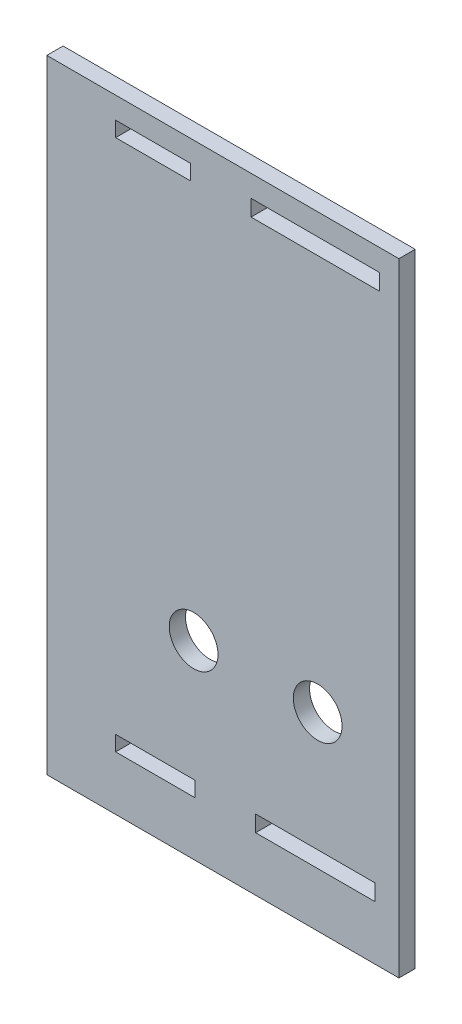
ISO-10303-21;
HEADER;
FILE_DESCRIPTION(('STEP AP214'),'2;1');
FILE_NAME('part.step','',(''),(''),'','','');
FILE_SCHEMA(('AUTOMOTIVE_DESIGN { 1 0 10303 214 1 1 1 1 }'));
ENDSEC;
DATA;
#1=APPLICATION_CONTEXT('core data for automotive mechanical design processes');
#2=APPLICATION_PROTOCOL_DEFINITION('international standard','automotive_design',2000,#1);
#3=PRODUCT_CONTEXT('',#1,'mechanical');
#4=PRODUCT('Part','Part','',(#3));
#5=PRODUCT_RELATED_PRODUCT_CATEGORY('part','',(#4));
#6=PRODUCT_DEFINITION_FORMATION('','',#4);
#7=PRODUCT_DEFINITION_CONTEXT('part definition',#1,'design');
#8=PRODUCT_DEFINITION('design','',#6,#7);
#9=PRODUCT_DEFINITION_SHAPE('','',#8);
#10=(LENGTH_UNIT() NAMED_UNIT(*) SI_UNIT(.MILLI.,.METRE.));
#11=(NAMED_UNIT(*) PLANE_ANGLE_UNIT() SI_UNIT($,.RADIAN.));
#12=(NAMED_UNIT(*) SI_UNIT($,.STERADIAN.) SOLID_ANGLE_UNIT());
#13=UNCERTAINTY_MEASURE_WITH_UNIT(LENGTH_MEASURE(1.E-05),#10,'distance_accuracy_value','');
#14=(GEOMETRIC_REPRESENTATION_CONTEXT(3) GLOBAL_UNCERTAINTY_ASSIGNED_CONTEXT((#13)) GLOBAL_UNIT_ASSIGNED_CONTEXT((#10,
#11,#12)) REPRESENTATION_CONTEXT('',''));
#15=CARTESIAN_POINT('',(0.,0.,0.));
#16=DIRECTION('',(0.,0.,1.));
#17=DIRECTION('',(1.,0.,0.));
#18=AXIS2_PLACEMENT_3D('',#15,#16,#17);
#19=CARTESIAN_POINT('',(0.,0.,3.));
#20=DIRECTION('',(0.,0.,1.));
#21=DIRECTION('',(1.,0.,0.));
#22=AXIS2_PLACEMENT_3D('',#19,#20,#21);
#23=PLANE('',#22);
#24=DIRECTION('',(0.,-1.,0.));
#25=VECTOR('',#24,1.);
#26=CARTESIAN_POINT('',(15.,57.5,3.));
#27=LINE('',#26,#25);
#28=CARTESIAN_POINT('',(15.,57.5,3.));
#29=VERTEX_POINT('',#28);
#30=CARTESIAN_POINT('',(15.,-57.5,3.));
#31=VERTEX_POINT('',#30);
#32=EDGE_CURVE('E182',#29,#31,#27,.T.);
#33=ORIENTED_EDGE('',*,*,#32,.F.);
#34=DIRECTION('',(-1.,0.,0.));
#35=VECTOR('',#34,1.);
#36=CARTESIAN_POINT('',(50.,57.5,3.));
#37=LINE('',#36,#35);
#38=CARTESIAN_POINT('',(-50.,57.5,3.));
#39=VERTEX_POINT('',#38);
#40=EDGE_CURVE('E214',#29,#39,#37,.T.);
#41=ORIENTED_EDGE('',*,*,#40,.T.);
#42=DIRECTION('',(0.,-1.,0.));
#43=VECTOR('',#42,1.);
#44=CARTESIAN_POINT('',(-50.,-57.5,3.));
#45=LINE('',#44,#43);
#46=CARTESIAN_POINT('',(-50.,-57.5,3.));
#47=VERTEX_POINT('',#46);
#48=EDGE_CURVE('E207',#39,#47,#45,.T.);
#49=ORIENTED_EDGE('',*,*,#48,.T.);
#50=DIRECTION('',(1.,0.,0.));
#51=VECTOR('',#50,1.);
#52=CARTESIAN_POINT('',(50.,-57.5,3.));
#53=LINE('',#52,#51);
#54=EDGE_CURVE('E219',#47,#31,#53,.T.);
#55=ORIENTED_EDGE('',*,*,#54,.T.);
#56=EDGE_LOOP('',(#33,#41,#49,#55));
#57=FACE_BOUND('',#56,.T.);
#58=CARTESIAN_POINT('',(-22.9,-22.5,3.));
#59=DIRECTION('',(0.,0.,1.));
#60=DIRECTION('',(1.,0.,0.));
#61=AXIS2_PLACEMENT_3D('',#58,#59,#60);
#62=CIRCLE('',#61,4.5);
#63=CARTESIAN_POINT('',(-18.4,-22.5,3.));
#64=VERTEX_POINT('',#63);
#65=EDGE_CURVE('E402',#64,#64,#62,.T.);
#66=ORIENTED_EDGE('',*,*,#65,.F.);
#67=EDGE_LOOP('',(#66));
#68=FACE_BOUND('',#67,.T.);
#69=DIRECTION('',(1.,0.,0.));
#70=VECTOR('',#69,1.);
#71=CARTESIAN_POINT('',(-12.3000000000001,50.5,3.));
#72=LINE('',#71,#70);
#73=CARTESIAN_POINT('',(-12.3000000000001,50.5,3.));
#74=VERTEX_POINT('',#73);
#75=CARTESIAN_POINT('',(11.4500000000001,50.5,3.));
#76=VERTEX_POINT('',#75);
#77=EDGE_CURVE('E393',#74,#76,#72,.T.);
#78=ORIENTED_EDGE('',*,*,#77,.F.);
#79=DIRECTION('',(0.,-1.,0.));
#80=VECTOR('',#79,1.);
#81=CARTESIAN_POINT('',(-12.3000000000001,53.5,3.));
#82=LINE('',#81,#80);
#83=CARTESIAN_POINT('',(-12.3000000000001,53.5,3.));
#84=VERTEX_POINT('',#83);
#85=EDGE_CURVE('E374',#84,#74,#82,.T.);
#86=ORIENTED_EDGE('',*,*,#85,.F.);
#87=DIRECTION('',(-1.,0.,0.));
#88=VECTOR('',#87,1.);
#89=CARTESIAN_POINT('',(-12.3000000000001,53.5,3.));
#90=LINE('',#89,#88);
#91=CARTESIAN_POINT('',(11.4500000000001,53.5,3.));
#92=VERTEX_POINT('',#91);
#93=EDGE_CURVE('E369',#92,#84,#90,.T.);
#94=ORIENTED_EDGE('',*,*,#93,.F.);
#95=DIRECTION('',(0.,1.,0.));
#96=VECTOR('',#95,1.);
#97=CARTESIAN_POINT('',(11.4500000000001,53.5,3.));
#98=LINE('',#97,#96);
#99=EDGE_CURVE('E390',#76,#92,#98,.T.);
#100=ORIENTED_EDGE('',*,*,#99,.F.);
#101=EDGE_LOOP('',(#78,#86,#94,#100));
#102=FACE_BOUND('',#101,.T.);
#103=DIRECTION('',(1.,0.,0.));
#104=VECTOR('',#103,1.);
#105=CARTESIAN_POINT('',(-37.3,50.7,3.));
#106=LINE('',#105,#104);
#107=CARTESIAN_POINT('',(-37.3,50.7,3.));
#108=VERTEX_POINT('',#107);
#109=CARTESIAN_POINT('',(-23.4500000000001,50.7,3.));
#110=VERTEX_POINT('',#109);
#111=EDGE_CURVE('E352',#108,#110,#106,.T.);
#112=ORIENTED_EDGE('',*,*,#111,.F.);
#113=DIRECTION('',(0.,-1.,0.));
#114=VECTOR('',#113,1.);
#115=CARTESIAN_POINT('',(-37.3,53.5,3.));
#116=LINE('',#115,#114);
#117=CARTESIAN_POINT('',(-37.3,53.5,3.));
#118=VERTEX_POINT('',#117);
#119=EDGE_CURVE('E332',#118,#108,#116,.T.);
#120=ORIENTED_EDGE('',*,*,#119,.F.);
#121=DIRECTION('',(-1.,0.,0.));
#122=VECTOR('',#121,1.);
#123=CARTESIAN_POINT('',(-37.3,53.5,3.));
#124=LINE('',#123,#122);
#125=CARTESIAN_POINT('',(-23.4500000000001,53.5,3.));
#126=VERTEX_POINT('',#125);
#127=EDGE_CURVE('E327',#126,#118,#124,.T.);
#128=ORIENTED_EDGE('',*,*,#127,.F.);
#129=DIRECTION('',(0.,1.,0.));
#130=VECTOR('',#129,1.);
#131=CARTESIAN_POINT('',(-23.4500000000001,53.5,3.));
#132=LINE('',#131,#130);
#133=EDGE_CURVE('E348',#110,#126,#132,.T.);
#134=ORIENTED_EDGE('',*,*,#133,.F.);
#135=EDGE_LOOP('',(#112,#120,#128,#134));
#136=FACE_BOUND('',#135,.T.);
#137=DIRECTION('',(1.,0.,0.));
#138=VECTOR('',#137,1.);
#139=CARTESIAN_POINT('',(-11.45,-47.5,3.));
#140=LINE('',#139,#138);
#141=CARTESIAN_POINT('',(-11.45,-47.5,3.));
#142=VERTEX_POINT('',#141);
#143=CARTESIAN_POINT('',(10.6,-47.5,3.));
#144=VERTEX_POINT('',#143);
#145=EDGE_CURVE('E309',#142,#144,#140,.T.);
#146=ORIENTED_EDGE('',*,*,#145,.F.);
#147=DIRECTION('',(0.,-1.,0.));
#148=VECTOR('',#147,1.);
#149=CARTESIAN_POINT('',(-11.45,-47.5,3.));
#150=LINE('',#149,#148);
#151=CARTESIAN_POINT('',(-11.45,-44.5,3.));
#152=VERTEX_POINT('',#151);
#153=EDGE_CURVE('E289',#152,#142,#150,.T.);
#154=ORIENTED_EDGE('',*,*,#153,.F.);
#155=DIRECTION('',(-1.,0.,0.));
#156=VECTOR('',#155,1.);
#157=CARTESIAN_POINT('',(-11.45,-44.5,3.));
#158=LINE('',#157,#156);
#159=CARTESIAN_POINT('',(10.6,-44.5,3.));
#160=VERTEX_POINT('',#159);
#161=EDGE_CURVE('E284',#160,#152,#158,.T.);
#162=ORIENTED_EDGE('',*,*,#161,.F.);
#163=DIRECTION('',(0.,1.,0.));
#164=VECTOR('',#163,1.);
#165=CARTESIAN_POINT('',(10.6,-47.5,3.));
#166=LINE('',#165,#164);
#167=EDGE_CURVE('E305',#144,#160,#166,.T.);
#168=ORIENTED_EDGE('',*,*,#167,.F.);
#169=EDGE_LOOP('',(#146,#154,#162,#168));
#170=FACE_BOUND('',#169,.T.);
#171=DIRECTION('',(0.,1.,0.));
#172=VECTOR('',#171,1.);
#173=CARTESIAN_POINT('',(-22.6,-47.5,3.));
#174=LINE('',#173,#172);
#175=CARTESIAN_POINT('',(-22.6,-47.5,3.));
#176=VERTEX_POINT('',#175);
#177=CARTESIAN_POINT('',(-22.6,-44.7,3.));
#178=VERTEX_POINT('',#177);
#179=EDGE_CURVE('E266',#176,#178,#174,.T.);
#180=ORIENTED_EDGE('',*,*,#179,.F.);
#181=DIRECTION('',(1.,0.,0.));
#182=VECTOR('',#181,1.);
#183=CARTESIAN_POINT('',(-22.6,-47.5,3.));
#184=LINE('',#183,#182);
#185=CARTESIAN_POINT('',(-37.3,-47.5,3.));
#186=VERTEX_POINT('',#185);
#187=EDGE_CURVE('E246',#186,#176,#184,.T.);
#188=ORIENTED_EDGE('',*,*,#187,.F.);
#189=DIRECTION('',(0.,-1.,0.));
#190=VECTOR('',#189,1.);
#191=CARTESIAN_POINT('',(-37.3,-47.5,3.));
#192=LINE('',#191,#190);
#193=CARTESIAN_POINT('',(-37.3,-44.7,3.));
#194=VERTEX_POINT('',#193);
#195=EDGE_CURVE('E241',#194,#186,#192,.T.);
#196=ORIENTED_EDGE('',*,*,#195,.F.);
#197=DIRECTION('',(-1.,0.,0.));
#198=VECTOR('',#197,1.);
#199=CARTESIAN_POINT('',(-22.6,-44.7,3.));
#200=LINE('',#199,#198);
#201=EDGE_CURVE('E262',#178,#194,#200,.T.);
#202=ORIENTED_EDGE('',*,*,#201,.F.);
#203=EDGE_LOOP('',(#180,#188,#196,#202));
#204=FACE_BOUND('',#203,.T.);
#205=CARTESIAN_POINT('',(0.,-22.5,3.));
#206=DIRECTION('',(0.,0.,1.));
#207=DIRECTION('',(1.,0.,0.));
#208=AXIS2_PLACEMENT_3D('',#205,#206,#207);
#209=CIRCLE('',#208,4.5);
#210=CARTESIAN_POINT('',(4.50000000000001,-22.5,3.));
#211=VERTEX_POINT('',#210);
#212=EDGE_CURVE('E387',#211,#211,#209,.T.);
#213=ORIENTED_EDGE('',*,*,#212,.F.);
#214=EDGE_LOOP('',(#213));
#215=FACE_BOUND('',#214,.T.);
#216=ADVANCED_FACE('F43',(#57,#68,#102,#136,#170,#204,#215),#23,.T.);
#217=CARTESIAN_POINT('',(0.,0.,0.));
#218=DIRECTION('',(0.,0.,1.));
#219=DIRECTION('',(1.,0.,0.));
#220=AXIS2_PLACEMENT_3D('',#217,#218,#219);
#221=PLANE('',#220);
#222=DIRECTION('',(0.,-1.,0.));
#223=VECTOR('',#222,1.);
#224=CARTESIAN_POINT('',(-11.45,-47.5,0.));
#225=LINE('',#224,#223);
#226=CARTESIAN_POINT('',(-11.45,-44.5,0.));
#227=VERTEX_POINT('',#226);
#228=CARTESIAN_POINT('',(-11.45,-47.5,0.));
#229=VERTEX_POINT('',#228);
#230=EDGE_CURVE('E298',#227,#229,#225,.T.);
#231=ORIENTED_EDGE('',*,*,#230,.T.);
#232=DIRECTION('',(1.,0.,0.));
#233=VECTOR('',#232,1.);
#234=CARTESIAN_POINT('',(-11.45,-47.5,0.));
#235=LINE('',#234,#233);
#236=CARTESIAN_POINT('',(10.6,-47.5,0.));
#237=VERTEX_POINT('',#236);
#238=EDGE_CURVE('E294',#229,#237,#235,.T.);
#239=ORIENTED_EDGE('',*,*,#238,.T.);
#240=DIRECTION('',(0.,1.,0.));
#241=VECTOR('',#240,1.);
#242=CARTESIAN_POINT('',(10.6,-47.5,0.));
#243=LINE('',#242,#241);
#244=CARTESIAN_POINT('',(10.6,-44.5,0.));
#245=VERTEX_POINT('',#244);
#246=EDGE_CURVE('E290',#237,#245,#243,.T.);
#247=ORIENTED_EDGE('',*,*,#246,.T.);
#248=DIRECTION('',(-1.,0.,0.));
#249=VECTOR('',#248,1.);
#250=CARTESIAN_POINT('',(-11.45,-44.5,0.));
#251=LINE('',#250,#249);
#252=EDGE_CURVE('E285',#245,#227,#251,.T.);
#253=ORIENTED_EDGE('',*,*,#252,.T.);
#254=EDGE_LOOP('',(#231,#239,#247,#253));
#255=FACE_BOUND('',#254,.T.);
#256=DIRECTION('',(-1.,0.,0.));
#257=VECTOR('',#256,1.);
#258=CARTESIAN_POINT('',(50.,57.5,0.));
#259=LINE('',#258,#257);
#260=CARTESIAN_POINT('',(15.,57.5,0.));
#261=VERTEX_POINT('',#260);
#262=CARTESIAN_POINT('',(-50.,57.5,0.));
#263=VERTEX_POINT('',#262);
#264=EDGE_CURVE('E196',#261,#263,#259,.T.);
#265=ORIENTED_EDGE('',*,*,#264,.F.);
#266=DIRECTION('',(0.,-1.,0.));
#267=VECTOR('',#266,1.);
#268=CARTESIAN_POINT('',(15.,57.5,0.));
#269=LINE('',#268,#267);
#270=CARTESIAN_POINT('',(15.,-57.5,0.));
#271=VERTEX_POINT('',#270);
#272=EDGE_CURVE('E59',#261,#271,#269,.T.);
#273=ORIENTED_EDGE('',*,*,#272,.T.);
#274=DIRECTION('',(1.,0.,0.));
#275=VECTOR('',#274,1.);
#276=CARTESIAN_POINT('',(50.,-57.5,0.));
#277=LINE('',#276,#275);
#278=CARTESIAN_POINT('',(-50.,-57.5,0.));
#279=VERTEX_POINT('',#278);
#280=EDGE_CURVE('E195',#279,#271,#277,.T.);
#281=ORIENTED_EDGE('',*,*,#280,.F.);
#282=DIRECTION('',(0.,-1.,0.));
#283=VECTOR('',#282,1.);
#284=CARTESIAN_POINT('',(-50.,-57.5,0.));
#285=LINE('',#284,#283);
#286=EDGE_CURVE('E203',#263,#279,#285,.T.);
#287=ORIENTED_EDGE('',*,*,#286,.F.);
#288=EDGE_LOOP('',(#265,#273,#281,#287));
#289=FACE_BOUND('',#288,.T.);
#290=DIRECTION('',(1.,0.,0.));
#291=VECTOR('',#290,1.);
#292=CARTESIAN_POINT('',(-22.6,-47.5,0.));
#293=LINE('',#292,#291);
#294=CARTESIAN_POINT('',(-37.3,-47.5,0.));
#295=VERTEX_POINT('',#294);
#296=CARTESIAN_POINT('',(-22.6,-47.5,0.));
#297=VERTEX_POINT('',#296);
#298=EDGE_CURVE('E255',#295,#297,#293,.T.);
#299=ORIENTED_EDGE('',*,*,#298,.T.);
#300=DIRECTION('',(0.,1.,0.));
#301=VECTOR('',#300,1.);
#302=CARTESIAN_POINT('',(-22.6,-47.5,0.));
#303=LINE('',#302,#301);
#304=CARTESIAN_POINT('',(-22.6,-44.7,0.));
#305=VERTEX_POINT('',#304);
#306=EDGE_CURVE('E251',#297,#305,#303,.T.);
#307=ORIENTED_EDGE('',*,*,#306,.T.);
#308=DIRECTION('',(-1.,0.,0.));
#309=VECTOR('',#308,1.);
#310=CARTESIAN_POINT('',(-22.6,-44.7,0.));
#311=LINE('',#310,#309);
#312=CARTESIAN_POINT('',(-37.3,-44.7,0.));
#313=VERTEX_POINT('',#312);
#314=EDGE_CURVE('E247',#305,#313,#311,.T.);
#315=ORIENTED_EDGE('',*,*,#314,.T.);
#316=DIRECTION('',(0.,-1.,0.));
#317=VECTOR('',#316,1.);
#318=CARTESIAN_POINT('',(-37.3,-47.5,0.));
#319=LINE('',#318,#317);
#320=EDGE_CURVE('E242',#313,#295,#319,.T.);
#321=ORIENTED_EDGE('',*,*,#320,.T.);
#322=EDGE_LOOP('',(#299,#307,#315,#321));
#323=FACE_BOUND('',#322,.T.);
#324=DIRECTION('',(0.,-1.,0.));
#325=VECTOR('',#324,1.);
#326=CARTESIAN_POINT('',(-37.3,53.5,0.));
#327=LINE('',#326,#325);
#328=CARTESIAN_POINT('',(-37.3,53.5,0.));
#329=VERTEX_POINT('',#328);
#330=CARTESIAN_POINT('',(-37.3,50.7,0.));
#331=VERTEX_POINT('',#330);
#332=EDGE_CURVE('E341',#329,#331,#327,.T.);
#333=ORIENTED_EDGE('',*,*,#332,.T.);
#334=DIRECTION('',(1.,0.,0.));
#335=VECTOR('',#334,1.);
#336=CARTESIAN_POINT('',(-37.3,50.7,0.));
#337=LINE('',#336,#335);
#338=CARTESIAN_POINT('',(-23.4500000000001,50.7,0.));
#339=VERTEX_POINT('',#338);
#340=EDGE_CURVE('E337',#331,#339,#337,.T.);
#341=ORIENTED_EDGE('',*,*,#340,.T.);
#342=DIRECTION('',(0.,1.,0.));
#343=VECTOR('',#342,1.);
#344=CARTESIAN_POINT('',(-23.4500000000001,53.5,0.));
#345=LINE('',#344,#343);
#346=CARTESIAN_POINT('',(-23.4500000000001,53.5,0.));
#347=VERTEX_POINT('',#346);
#348=EDGE_CURVE('E333',#339,#347,#345,.T.);
#349=ORIENTED_EDGE('',*,*,#348,.T.);
#350=DIRECTION('',(-1.,0.,0.));
#351=VECTOR('',#350,1.);
#352=CARTESIAN_POINT('',(-37.3,53.5,0.));
#353=LINE('',#352,#351);
#354=EDGE_CURVE('E328',#347,#329,#353,.T.);
#355=ORIENTED_EDGE('',*,*,#354,.T.);
#356=EDGE_LOOP('',(#333,#341,#349,#355));
#357=FACE_BOUND('',#356,.T.);
#358=DIRECTION('',(0.,-1.,0.));
#359=VECTOR('',#358,1.);
#360=CARTESIAN_POINT('',(-12.3000000000001,53.5,0.));
#361=LINE('',#360,#359);
#362=CARTESIAN_POINT('',(-12.3000000000001,53.5,0.));
#363=VERTEX_POINT('',#362);
#364=CARTESIAN_POINT('',(-12.3000000000001,50.5,0.));
#365=VERTEX_POINT('',#364);
#366=EDGE_CURVE('E383',#363,#365,#361,.T.);
#367=ORIENTED_EDGE('',*,*,#366,.T.);
#368=DIRECTION('',(1.,0.,0.));
#369=VECTOR('',#368,1.);
#370=CARTESIAN_POINT('',(-12.3000000000001,50.5,0.));
#371=LINE('',#370,#369);
#372=CARTESIAN_POINT('',(11.4500000000001,50.5,0.));
#373=VERTEX_POINT('',#372);
#374=EDGE_CURVE('E379',#365,#373,#371,.T.);
#375=ORIENTED_EDGE('',*,*,#374,.T.);
#376=DIRECTION('',(0.,1.,0.));
#377=VECTOR('',#376,1.);
#378=CARTESIAN_POINT('',(11.4500000000001,53.5,0.));
#379=LINE('',#378,#377);
#380=CARTESIAN_POINT('',(11.4500000000001,53.5,0.));
#381=VERTEX_POINT('',#380);
#382=EDGE_CURVE('E375',#373,#381,#379,.T.);
#383=ORIENTED_EDGE('',*,*,#382,.T.);
#384=DIRECTION('',(-1.,0.,0.));
#385=VECTOR('',#384,1.);
#386=CARTESIAN_POINT('',(-12.3000000000001,53.5,0.));
#387=LINE('',#386,#385);
#388=EDGE_CURVE('E370',#381,#363,#387,.T.);
#389=ORIENTED_EDGE('',*,*,#388,.T.);
#390=EDGE_LOOP('',(#367,#375,#383,#389));
#391=FACE_BOUND('',#390,.T.);
#392=CARTESIAN_POINT('',(0.,-22.5,0.));
#393=DIRECTION('',(0.,0.,1.));
#394=DIRECTION('',(1.,0.,0.));
#395=AXIS2_PLACEMENT_3D('',#392,#393,#394);
#396=CIRCLE('',#395,4.5);
#397=CARTESIAN_POINT('',(4.50000000000001,-22.5,0.));
#398=VERTEX_POINT('',#397);
#399=EDGE_CURVE('E398',#398,#398,#396,.T.);
#400=ORIENTED_EDGE('',*,*,#399,.T.);
#401=EDGE_LOOP('',(#400));
#402=FACE_BOUND('',#401,.T.);
#403=CARTESIAN_POINT('',(-22.9,-22.5,0.));
#404=DIRECTION('',(0.,0.,1.));
#405=DIRECTION('',(1.,0.,0.));
#406=AXIS2_PLACEMENT_3D('',#403,#404,#405);
#407=CIRCLE('',#406,4.5);
#408=CARTESIAN_POINT('',(-18.4,-22.5,0.));
#409=VERTEX_POINT('',#408);
#410=EDGE_CURVE('E187',#409,#409,#407,.T.);
#411=ORIENTED_EDGE('',*,*,#410,.T.);
#412=EDGE_LOOP('',(#411));
#413=FACE_BOUND('',#412,.T.);
#414=ADVANCED_FACE('F192',(#255,#289,#323,#357,#391,#402,#413),#221,.F.);
#415=CARTESIAN_POINT('',(-50.,-57.5,3.));
#416=DIRECTION('',(1.,0.,0.));
#417=DIRECTION('',(0.,0.,-1.));
#418=AXIS2_PLACEMENT_3D('',#415,#416,#417);
#419=PLANE('',#418);
#420=ORIENTED_EDGE('',*,*,#286,.T.);
#421=DIRECTION('',(0.,0.,-1.));
#422=VECTOR('',#421,1.);
#423=CARTESIAN_POINT('',(-50.,-57.5,3.));
#424=LINE('',#423,#422);
#425=EDGE_CURVE('E11',#47,#279,#424,.T.);
#426=ORIENTED_EDGE('',*,*,#425,.F.);
#427=ORIENTED_EDGE('',*,*,#48,.F.);
#428=DIRECTION('',(0.,0.,-1.));
#429=VECTOR('',#428,1.);
#430=CARTESIAN_POINT('',(-50.,57.5,3.));
#431=LINE('',#430,#429);
#432=EDGE_CURVE('E52',#39,#263,#431,.T.);
#433=ORIENTED_EDGE('',*,*,#432,.T.);
#434=EDGE_LOOP('',(#420,#426,#427,#433));
#435=FACE_BOUND('',#434,.T.);
#436=ADVANCED_FACE('F45',(#435),#419,.F.);
#437=CARTESIAN_POINT('',(50.,-57.5,3.));
#438=DIRECTION('',(0.,1.,0.));
#439=DIRECTION('',(-1.,0.,0.));
#440=AXIS2_PLACEMENT_3D('',#437,#438,#439);
#441=PLANE('',#440);
#442=ORIENTED_EDGE('',*,*,#280,.T.);
#443=DIRECTION('',(0.,0.,1.));
#444=VECTOR('',#443,1.);
#445=CARTESIAN_POINT('',(15.,-57.5,0.));
#446=LINE('',#445,#444);
#447=EDGE_CURVE('E179',#271,#31,#446,.T.);
#448=ORIENTED_EDGE('',*,*,#447,.T.);
#449=ORIENTED_EDGE('',*,*,#54,.F.);
#450=ORIENTED_EDGE('',*,*,#425,.T.);
#451=EDGE_LOOP('',(#442,#448,#449,#450));
#452=FACE_BOUND('',#451,.T.);
#453=ADVANCED_FACE('F199',(#452),#441,.F.);
#454=CARTESIAN_POINT('',(50.,57.5,3.));
#455=DIRECTION('',(0.,-1.,0.));
#456=DIRECTION('',(1.,0.,0.));
#457=AXIS2_PLACEMENT_3D('',#454,#455,#456);
#458=PLANE('',#457);
#459=ORIENTED_EDGE('',*,*,#40,.F.);
#460=DIRECTION('',(0.,0.,1.));
#461=VECTOR('',#460,1.);
#462=CARTESIAN_POINT('',(15.,57.5,0.));
#463=LINE('',#462,#461);
#464=EDGE_CURVE('E188',#261,#29,#463,.T.);
#465=ORIENTED_EDGE('',*,*,#464,.F.);
#466=ORIENTED_EDGE('',*,*,#264,.T.);
#467=ORIENTED_EDGE('',*,*,#432,.F.);
#468=EDGE_LOOP('',(#459,#465,#466,#467));
#469=FACE_BOUND('',#468,.T.);
#470=ADVANCED_FACE('F417',(#469),#458,.F.);
#471=CARTESIAN_POINT('',(-22.6,-47.5,3.));
#472=DIRECTION('',(0.,1.,0.));
#473=DIRECTION('',(0.,0.,1.));
#474=AXIS2_PLACEMENT_3D('',#471,#472,#473);
#475=PLANE('',#474);
#476=ORIENTED_EDGE('',*,*,#298,.F.);
#477=DIRECTION('',(0.,0.,-1.));
#478=VECTOR('',#477,1.);
#479=CARTESIAN_POINT('',(-37.3,-47.5,3.));
#480=LINE('',#479,#478);
#481=EDGE_CURVE('E237',#186,#295,#480,.T.);
#482=ORIENTED_EDGE('',*,*,#481,.F.);
#483=ORIENTED_EDGE('',*,*,#187,.T.);
#484=DIRECTION('',(0.,0.,-1.));
#485=VECTOR('',#484,1.);
#486=CARTESIAN_POINT('',(-22.6,-47.5,3.));
#487=LINE('',#486,#485);
#488=EDGE_CURVE('E209',#176,#297,#487,.T.);
#489=ORIENTED_EDGE('',*,*,#488,.T.);
#490=EDGE_LOOP('',(#476,#482,#483,#489));
#491=FACE_BOUND('',#490,.T.);
#492=ADVANCED_FACE('F430',(#491),#475,.T.);
#493=CARTESIAN_POINT('',(-22.6,-47.5,3.));
#494=DIRECTION('',(-1.,0.,0.));
#495=DIRECTION('',(0.,-1.,0.));
#496=AXIS2_PLACEMENT_3D('',#493,#494,#495);
#497=PLANE('',#496);
#498=ORIENTED_EDGE('',*,*,#306,.F.);
#499=ORIENTED_EDGE('',*,*,#488,.F.);
#500=ORIENTED_EDGE('',*,*,#179,.T.);
#501=DIRECTION('',(0.,0.,-1.));
#502=VECTOR('',#501,1.);
#503=CARTESIAN_POINT('',(-22.6,-44.7,3.));
#504=LINE('',#503,#502);
#505=EDGE_CURVE('E231',#178,#305,#504,.T.);
#506=ORIENTED_EDGE('',*,*,#505,.T.);
#507=EDGE_LOOP('',(#498,#499,#500,#506));
#508=FACE_BOUND('',#507,.T.);
#509=ADVANCED_FACE('F437',(#508),#497,.T.);
#510=CARTESIAN_POINT('',(-22.6,-44.7,3.));
#511=DIRECTION('',(0.,-1.,0.));
#512=DIRECTION('',(0.,0.,-1.));
#513=AXIS2_PLACEMENT_3D('',#510,#511,#512);
#514=PLANE('',#513);
#515=ORIENTED_EDGE('',*,*,#314,.F.);
#516=ORIENTED_EDGE('',*,*,#505,.F.);
#517=ORIENTED_EDGE('',*,*,#201,.T.);
#518=DIRECTION('',(0.,0.,-1.));
#519=VECTOR('',#518,1.);
#520=CARTESIAN_POINT('',(-37.3,-44.7,3.));
#521=LINE('',#520,#519);
#522=EDGE_CURVE('E234',#194,#313,#521,.T.);
#523=ORIENTED_EDGE('',*,*,#522,.T.);
#524=EDGE_LOOP('',(#515,#516,#517,#523));
#525=FACE_BOUND('',#524,.T.);
#526=ADVANCED_FACE('F442',(#525),#514,.T.);
#527=CARTESIAN_POINT('',(-37.3,-47.5,3.));
#528=DIRECTION('',(1.,0.,0.));
#529=DIRECTION('',(0.,0.,-1.));
#530=AXIS2_PLACEMENT_3D('',#527,#528,#529);
#531=PLANE('',#530);
#532=ORIENTED_EDGE('',*,*,#320,.F.);
#533=ORIENTED_EDGE('',*,*,#522,.F.);
#534=ORIENTED_EDGE('',*,*,#195,.T.);
#535=ORIENTED_EDGE('',*,*,#481,.T.);
#536=EDGE_LOOP('',(#532,#533,#534,#535));
#537=FACE_BOUND('',#536,.T.);
#538=ADVANCED_FACE('F449',(#537),#531,.T.);
#539=CARTESIAN_POINT('',(-11.45,-47.5,3.));
#540=DIRECTION('',(1.,0.,0.));
#541=DIRECTION('',(0.,0.,-1.));
#542=AXIS2_PLACEMENT_3D('',#539,#540,#541);
#543=PLANE('',#542);
#544=ORIENTED_EDGE('',*,*,#230,.F.);
#545=DIRECTION('',(0.,0.,-1.));
#546=VECTOR('',#545,1.);
#547=CARTESIAN_POINT('',(-11.45,-44.5,3.));
#548=LINE('',#547,#546);
#549=EDGE_CURVE('E280',#152,#227,#548,.T.);
#550=ORIENTED_EDGE('',*,*,#549,.F.);
#551=ORIENTED_EDGE('',*,*,#153,.T.);
#552=DIRECTION('',(0.,0.,-1.));
#553=VECTOR('',#552,1.);
#554=CARTESIAN_POINT('',(-11.45,-47.5,3.));
#555=LINE('',#554,#553);
#556=EDGE_CURVE('E259',#142,#229,#555,.T.);
#557=ORIENTED_EDGE('',*,*,#556,.T.);
#558=EDGE_LOOP('',(#544,#550,#551,#557));
#559=FACE_BOUND('',#558,.T.);
#560=ADVANCED_FACE('F521',(#559),#543,.T.);
#561=CARTESIAN_POINT('',(-11.45,-47.5,3.));
#562=DIRECTION('',(0.,1.,0.));
#563=DIRECTION('',(0.,0.,1.));
#564=AXIS2_PLACEMENT_3D('',#561,#562,#563);
#565=PLANE('',#564);
#566=ORIENTED_EDGE('',*,*,#238,.F.);
#567=ORIENTED_EDGE('',*,*,#556,.F.);
#568=ORIENTED_EDGE('',*,*,#145,.T.);
#569=DIRECTION('',(0.,0.,-1.));
#570=VECTOR('',#569,1.);
#571=CARTESIAN_POINT('',(10.6,-47.5,3.));
#572=LINE('',#571,#570);
#573=EDGE_CURVE('E274',#144,#237,#572,.T.);
#574=ORIENTED_EDGE('',*,*,#573,.T.);
#575=EDGE_LOOP('',(#566,#567,#568,#574));
#576=FACE_BOUND('',#575,.T.);
#577=ADVANCED_FACE('F517',(#576),#565,.T.);
#578=CARTESIAN_POINT('',(10.6,-47.5,3.));
#579=DIRECTION('',(-1.,0.,0.));
#580=DIRECTION('',(0.,0.,1.));
#581=AXIS2_PLACEMENT_3D('',#578,#579,#580);
#582=PLANE('',#581);
#583=ORIENTED_EDGE('',*,*,#246,.F.);
#584=ORIENTED_EDGE('',*,*,#573,.F.);
#585=ORIENTED_EDGE('',*,*,#167,.T.);
#586=DIRECTION('',(0.,0.,-1.));
#587=VECTOR('',#586,1.);
#588=CARTESIAN_POINT('',(10.6,-44.5,3.));
#589=LINE('',#588,#587);
#590=EDGE_CURVE('E277',#160,#245,#589,.T.);
#591=ORIENTED_EDGE('',*,*,#590,.T.);
#592=EDGE_LOOP('',(#583,#584,#585,#591));
#593=FACE_BOUND('',#592,.T.);
#594=ADVANCED_FACE('F513',(#593),#582,.T.);
#595=CARTESIAN_POINT('',(-11.45,-44.5,3.));
#596=DIRECTION('',(0.,-1.,0.));
#597=DIRECTION('',(1.,0.,0.));
#598=AXIS2_PLACEMENT_3D('',#595,#596,#597);
#599=PLANE('',#598);
#600=ORIENTED_EDGE('',*,*,#252,.F.);
#601=ORIENTED_EDGE('',*,*,#590,.F.);
#602=ORIENTED_EDGE('',*,*,#161,.T.);
#603=ORIENTED_EDGE('',*,*,#549,.T.);
#604=EDGE_LOOP('',(#600,#601,#602,#603));
#605=FACE_BOUND('',#604,.T.);
#606=ADVANCED_FACE('F509',(#605),#599,.T.);
#607=CARTESIAN_POINT('',(-37.3,53.5,3.));
#608=DIRECTION('',(1.,0.,0.));
#609=DIRECTION('',(0.,1.,0.));
#610=AXIS2_PLACEMENT_3D('',#607,#608,#609);
#611=PLANE('',#610);
#612=ORIENTED_EDGE('',*,*,#332,.F.);
#613=DIRECTION('',(0.,0.,-1.));
#614=VECTOR('',#613,1.);
#615=CARTESIAN_POINT('',(-37.3,53.5,3.));
#616=LINE('',#615,#614);
#617=EDGE_CURVE('E323',#118,#329,#616,.T.);
#618=ORIENTED_EDGE('',*,*,#617,.F.);
#619=ORIENTED_EDGE('',*,*,#119,.T.);
#620=DIRECTION('',(0.,0.,-1.));
#621=VECTOR('',#620,1.);
#622=CARTESIAN_POINT('',(-37.3,50.7,3.));
#623=LINE('',#622,#621);
#624=EDGE_CURVE('E302',#108,#331,#623,.T.);
#625=ORIENTED_EDGE('',*,*,#624,.T.);
#626=EDGE_LOOP('',(#612,#618,#619,#625));
#627=FACE_BOUND('',#626,.T.);
#628=ADVANCED_FACE('F505',(#627),#611,.T.);
#629=CARTESIAN_POINT('',(-37.3,50.7,3.));
#630=DIRECTION('',(0.,1.,0.));
#631=DIRECTION('',(-1.,0.,0.));
#632=AXIS2_PLACEMENT_3D('',#629,#630,#631);
#633=PLANE('',#632);
#634=ORIENTED_EDGE('',*,*,#340,.F.);
#635=ORIENTED_EDGE('',*,*,#624,.F.);
#636=ORIENTED_EDGE('',*,*,#111,.T.);
#637=DIRECTION('',(0.,0.,-1.));
#638=VECTOR('',#637,1.);
#639=CARTESIAN_POINT('',(-23.4500000000001,50.7,3.));
#640=LINE('',#639,#638);
#641=EDGE_CURVE('E317',#110,#339,#640,.T.);
#642=ORIENTED_EDGE('',*,*,#641,.T.);
#643=EDGE_LOOP('',(#634,#635,#636,#642));
#644=FACE_BOUND('',#643,.T.);
#645=ADVANCED_FACE('F501',(#644),#633,.T.);
#646=CARTESIAN_POINT('',(-23.4500000000001,53.5,3.));
#647=DIRECTION('',(-1.,0.,0.));
#648=DIRECTION('',(0.,-1.,0.));
#649=AXIS2_PLACEMENT_3D('',#646,#647,#648);
#650=PLANE('',#649);
#651=ORIENTED_EDGE('',*,*,#348,.F.);
#652=ORIENTED_EDGE('',*,*,#641,.F.);
#653=ORIENTED_EDGE('',*,*,#133,.T.);
#654=DIRECTION('',(0.,0.,-1.));
#655=VECTOR('',#654,1.);
#656=CARTESIAN_POINT('',(-23.4500000000001,53.5,3.));
#657=LINE('',#656,#655);
#658=EDGE_CURVE('E320',#126,#347,#657,.T.);
#659=ORIENTED_EDGE('',*,*,#658,.T.);
#660=EDGE_LOOP('',(#651,#652,#653,#659));
#661=FACE_BOUND('',#660,.T.);
#662=ADVANCED_FACE('F497',(#661),#650,.T.);
#663=CARTESIAN_POINT('',(-37.3,53.5,3.));
#664=DIRECTION('',(0.,-1.,0.));
#665=DIRECTION('',(0.,0.,-1.));
#666=AXIS2_PLACEMENT_3D('',#663,#664,#665);
#667=PLANE('',#666);
#668=ORIENTED_EDGE('',*,*,#354,.F.);
#669=ORIENTED_EDGE('',*,*,#658,.F.);
#670=ORIENTED_EDGE('',*,*,#127,.T.);
#671=ORIENTED_EDGE('',*,*,#617,.T.);
#672=EDGE_LOOP('',(#668,#669,#670,#671));
#673=FACE_BOUND('',#672,.T.);
#674=ADVANCED_FACE('F493',(#673),#667,.T.);
#675=CARTESIAN_POINT('',(-12.3000000000001,53.5,3.));
#676=DIRECTION('',(1.,0.,0.));
#677=DIRECTION('',(0.,0.,-1.));
#678=AXIS2_PLACEMENT_3D('',#675,#676,#677);
#679=PLANE('',#678);
#680=ORIENTED_EDGE('',*,*,#366,.F.);
#681=DIRECTION('',(0.,0.,-1.));
#682=VECTOR('',#681,1.);
#683=CARTESIAN_POINT('',(-12.3000000000001,53.5,3.));
#684=LINE('',#683,#682);
#685=EDGE_CURVE('E365',#84,#363,#684,.T.);
#686=ORIENTED_EDGE('',*,*,#685,.F.);
#687=ORIENTED_EDGE('',*,*,#85,.T.);
#688=DIRECTION('',(0.,0.,-1.));
#689=VECTOR('',#688,1.);
#690=CARTESIAN_POINT('',(-12.3000000000001,50.5,3.));
#691=LINE('',#690,#689);
#692=EDGE_CURVE('E345',#74,#365,#691,.T.);
#693=ORIENTED_EDGE('',*,*,#692,.T.);
#694=EDGE_LOOP('',(#680,#686,#687,#693));
#695=FACE_BOUND('',#694,.T.);
#696=ADVANCED_FACE('F489',(#695),#679,.T.);
#697=CARTESIAN_POINT('',(-12.3000000000001,50.5,3.));
#698=DIRECTION('',(0.,1.,0.));
#699=DIRECTION('',(-1.,0.,0.));
#700=AXIS2_PLACEMENT_3D('',#697,#698,#699);
#701=PLANE('',#700);
#702=ORIENTED_EDGE('',*,*,#374,.F.);
#703=ORIENTED_EDGE('',*,*,#692,.F.);
#704=ORIENTED_EDGE('',*,*,#77,.T.);
#705=DIRECTION('',(0.,0.,-1.));
#706=VECTOR('',#705,1.);
#707=CARTESIAN_POINT('',(11.4500000000001,50.5,3.));
#708=LINE('',#707,#706);
#709=EDGE_CURVE('E360',#76,#373,#708,.T.);
#710=ORIENTED_EDGE('',*,*,#709,.T.);
#711=EDGE_LOOP('',(#702,#703,#704,#710));
#712=FACE_BOUND('',#711,.T.);
#713=ADVANCED_FACE('F485',(#712),#701,.T.);
#714=CARTESIAN_POINT('',(11.4500000000001,53.5,3.));
#715=DIRECTION('',(-1.,0.,0.));
#716=DIRECTION('',(0.,0.,1.));
#717=AXIS2_PLACEMENT_3D('',#714,#715,#716);
#718=PLANE('',#717);
#719=ORIENTED_EDGE('',*,*,#382,.F.);
#720=ORIENTED_EDGE('',*,*,#709,.F.);
#721=ORIENTED_EDGE('',*,*,#99,.T.);
#722=DIRECTION('',(0.,0.,-1.));
#723=VECTOR('',#722,1.);
#724=CARTESIAN_POINT('',(11.4500000000001,53.5,3.));
#725=LINE('',#724,#723);
#726=EDGE_CURVE('E67',#92,#381,#725,.T.);
#727=ORIENTED_EDGE('',*,*,#726,.T.);
#728=EDGE_LOOP('',(#719,#720,#721,#727));
#729=FACE_BOUND('',#728,.T.);
#730=ADVANCED_FACE('F482',(#729),#718,.T.);
#731=CARTESIAN_POINT('',(-12.3000000000001,53.5,3.));
#732=DIRECTION('',(0.,-1.,0.));
#733=DIRECTION('',(1.,0.,0.));
#734=AXIS2_PLACEMENT_3D('',#731,#732,#733);
#735=PLANE('',#734);
#736=ORIENTED_EDGE('',*,*,#388,.F.);
#737=ORIENTED_EDGE('',*,*,#726,.F.);
#738=ORIENTED_EDGE('',*,*,#93,.T.);
#739=ORIENTED_EDGE('',*,*,#685,.T.);
#740=EDGE_LOOP('',(#736,#737,#738,#739));
#741=FACE_BOUND('',#740,.T.);
#742=ADVANCED_FACE('F465',(#741),#735,.T.);
#743=CARTESIAN_POINT('',(0.,-22.5,3.));
#744=DIRECTION('',(0.,0.,-1.));
#745=DIRECTION('',(-1.,0.,0.));
#746=AXIS2_PLACEMENT_3D('',#743,#744,#745);
#747=CYLINDRICAL_SURFACE('',#746,4.5);
#748=ORIENTED_EDGE('',*,*,#212,.T.);
#749=EDGE_LOOP('',(#748));
#750=FACE_BOUND('',#749,.T.);
#751=ORIENTED_EDGE('',*,*,#399,.F.);
#752=EDGE_LOOP('',(#751));
#753=FACE_BOUND('',#752,.T.);
#754=ADVANCED_FACE('F461',(#750,#753),#747,.F.);
#755=CARTESIAN_POINT('',(-22.9,-22.5,3.));
#756=DIRECTION('',(0.,0.,-1.));
#757=DIRECTION('',(-1.,0.,0.));
#758=AXIS2_PLACEMENT_3D('',#755,#756,#757);
#759=CYLINDRICAL_SURFACE('',#758,4.5);
#760=ORIENTED_EDGE('',*,*,#65,.T.);
#761=EDGE_LOOP('',(#760));
#762=FACE_BOUND('',#761,.T.);
#763=ORIENTED_EDGE('',*,*,#410,.F.);
#764=EDGE_LOOP('',(#763));
#765=FACE_BOUND('',#764,.T.);
#766=ADVANCED_FACE('F464',(#762,#765),#759,.F.);
#767=CARTESIAN_POINT('',(15.,57.5,0.));
#768=DIRECTION('',(-1.,0.,0.));
#769=DIRECTION('',(0.,-1.,0.));
#770=AXIS2_PLACEMENT_3D('',#767,#768,#769);
#771=PLANE('',#770);
#772=ORIENTED_EDGE('',*,*,#32,.T.);
#773=ORIENTED_EDGE('',*,*,#447,.F.);
#774=ORIENTED_EDGE('',*,*,#272,.F.);
#775=ORIENTED_EDGE('',*,*,#464,.T.);
#776=EDGE_LOOP('',(#772,#773,#774,#775));
#777=FACE_BOUND('',#776,.T.);
#778=ADVANCED_FACE('F180',(#777),#771,.F.);
#779=CLOSED_SHELL('',(#216,#414,#436,#453,#470,#492,#509,#526,#538,#560,#577,#594,#606,#628,
#645,#662,#674,#696,#713,#730,#742,#754,#766,#778));
#780=MANIFOLD_SOLID_BREP('B2',#779);
#781=ADVANCED_BREP_SHAPE_REPRESENTATION('',(#18,#780),#14);
#782=SHAPE_DEFINITION_REPRESENTATION(#9,#781);
ENDSEC;
END-ISO-10303-21;
